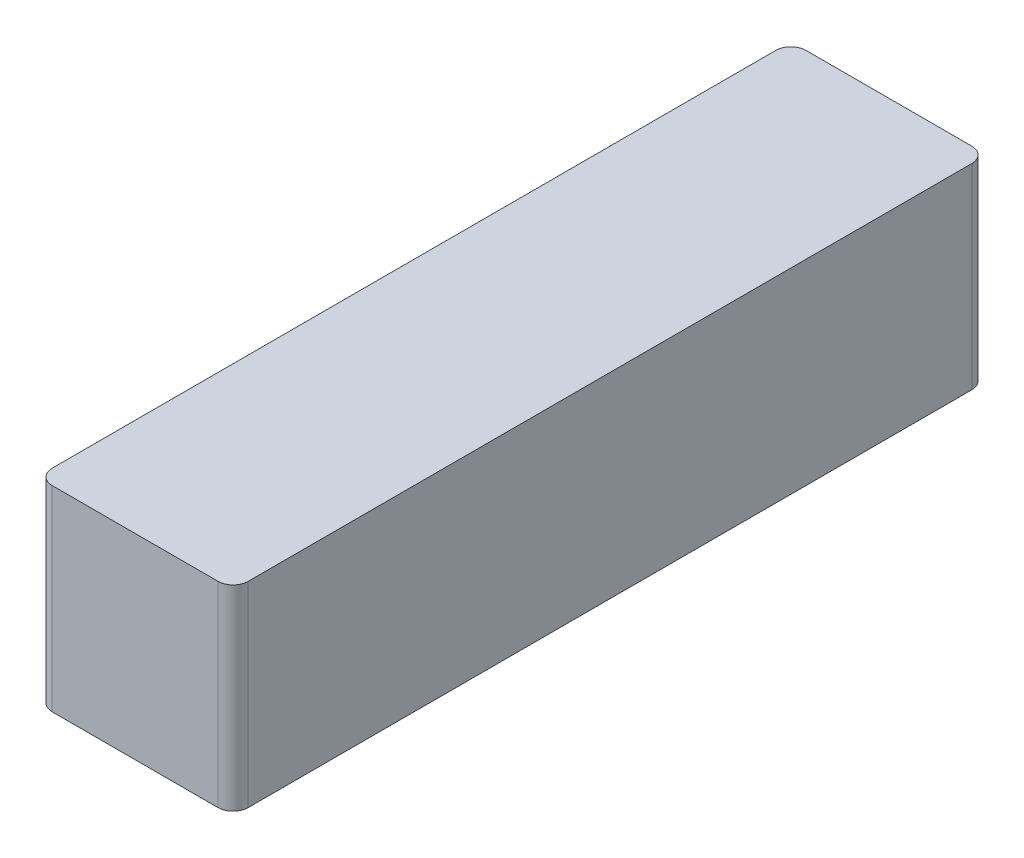
ISO-10303-21;
HEADER;
FILE_DESCRIPTION(('STEP AP214'),'2;1');
FILE_NAME('part.step','',(''),(''),'','','');
FILE_SCHEMA(('AUTOMOTIVE_DESIGN { 1 0 10303 214 1 1 1 1 }'));
ENDSEC;
DATA;
#1=APPLICATION_CONTEXT('core data for automotive mechanical design processes');
#2=APPLICATION_PROTOCOL_DEFINITION('international standard','automotive_design',2000,#1);
#3=PRODUCT_CONTEXT('',#1,'mechanical');
#4=PRODUCT('Part','Part','',(#3));
#5=PRODUCT_RELATED_PRODUCT_CATEGORY('part','',(#4));
#6=PRODUCT_DEFINITION_FORMATION('','',#4);
#7=PRODUCT_DEFINITION_CONTEXT('part definition',#1,'design');
#8=PRODUCT_DEFINITION('design','',#6,#7);
#9=PRODUCT_DEFINITION_SHAPE('','',#8);
#10=(LENGTH_UNIT() NAMED_UNIT(*) SI_UNIT(.MILLI.,.METRE.));
#11=(NAMED_UNIT(*) PLANE_ANGLE_UNIT() SI_UNIT($,.RADIAN.));
#12=(NAMED_UNIT(*) SI_UNIT($,.STERADIAN.) SOLID_ANGLE_UNIT());
#13=UNCERTAINTY_MEASURE_WITH_UNIT(LENGTH_MEASURE(1.E-05),#10,'distance_accuracy_value','');
#14=(GEOMETRIC_REPRESENTATION_CONTEXT(3) GLOBAL_UNCERTAINTY_ASSIGNED_CONTEXT((#13)) GLOBAL_UNIT_ASSIGNED_CONTEXT((#10,
#11,#12)) REPRESENTATION_CONTEXT('',''));
#15=CARTESIAN_POINT('',(0.,0.,0.));
#16=DIRECTION('',(0.,0.,1.));
#17=DIRECTION('',(1.,0.,0.));
#18=AXIS2_PLACEMENT_3D('',#15,#16,#17);
#19=CARTESIAN_POINT('',(1.651,1.651,12.7));
#20=DIRECTION('',(-1.,0.,0.));
#21=DIRECTION('',(0.,-1.,0.));
#22=AXIS2_PLACEMENT_3D('',#19,#20,#21);
#23=PLANE('',#22);
#24=DIRECTION('',(0.,0.,-1.));
#25=VECTOR('',#24,1.);
#26=CARTESIAN_POINT('',(1.651,-1.651,12.7));
#27=LINE('',#26,#25);
#28=CARTESIAN_POINT('',(1.651,-1.651,12.446));
#29=VERTEX_POINT('',#28);
#30=CARTESIAN_POINT('',(1.651,-1.651,0.254000000000001));
#31=VERTEX_POINT('',#30);
#32=EDGE_CURVE('E121',#29,#31,#27,.T.);
#33=ORIENTED_EDGE('',*,*,#32,.T.);
#34=DIRECTION('',(0.,1.,0.));
#35=VECTOR('',#34,1.);
#36=CARTESIAN_POINT('',(1.651,1.651,0.254000000000001));
#37=LINE('',#36,#35);
#38=CARTESIAN_POINT('',(1.651,1.651,0.254000000000001));
#39=VERTEX_POINT('',#38);
#40=EDGE_CURVE('E147',#31,#39,#37,.T.);
#41=ORIENTED_EDGE('',*,*,#40,.T.);
#42=DIRECTION('',(0.,0.,-1.));
#43=VECTOR('',#42,1.);
#44=CARTESIAN_POINT('',(1.651,1.651,12.7));
#45=LINE('',#44,#43);
#46=CARTESIAN_POINT('',(1.651,1.651,12.446));
#47=VERTEX_POINT('',#46);
#48=EDGE_CURVE('E126',#47,#39,#45,.T.);
#49=ORIENTED_EDGE('',*,*,#48,.F.);
#50=DIRECTION('',(0.,1.,0.));
#51=VECTOR('',#50,1.);
#52=CARTESIAN_POINT('',(1.651,-1.651,12.446));
#53=LINE('',#52,#51);
#54=EDGE_CURVE('E145',#47,#29,#53,.F.);
#55=ORIENTED_EDGE('',*,*,#54,.T.);
#56=EDGE_LOOP('',(#33,#41,#49,#55));
#57=FACE_BOUND('',#56,.T.);
#58=ADVANCED_FACE('F33',(#57),#23,.F.);
#59=CARTESIAN_POINT('',(-1.651,1.651,12.7));
#60=DIRECTION('',(0.,-1.,0.));
#61=DIRECTION('',(0.,0.,-1.));
#62=AXIS2_PLACEMENT_3D('',#59,#60,#61);
#63=PLANE('',#62);
#64=DIRECTION('',(-1.,0.,0.));
#65=VECTOR('',#64,1.);
#66=CARTESIAN_POINT('',(-1.651,1.651,0.));
#67=LINE('',#66,#65);
#68=CARTESIAN_POINT('',(1.397,1.651,0.));
#69=VERTEX_POINT('',#68);
#70=CARTESIAN_POINT('',(-1.397,1.651,0.));
#71=VERTEX_POINT('',#70);
#72=EDGE_CURVE('E162',#69,#71,#67,.T.);
#73=ORIENTED_EDGE('',*,*,#72,.T.);
#74=CARTESIAN_POINT('',(-1.397,1.651,0.254000000000001));
#75=DIRECTION('',(0.,-1.,0.));
#76=DIRECTION('',(0.,0.,-1.));
#77=AXIS2_PLACEMENT_3D('',#74,#75,#76);
#78=CIRCLE('',#77,0.254);
#79=CARTESIAN_POINT('',(-1.651,1.651,0.254000000000001));
#80=VERTEX_POINT('',#79);
#81=EDGE_CURVE('E143',#71,#80,#78,.F.);
#82=ORIENTED_EDGE('',*,*,#81,.T.);
#83=DIRECTION('',(0.,0.,-1.));
#84=VECTOR('',#83,1.);
#85=CARTESIAN_POINT('',(-1.651,1.651,12.7));
#86=LINE('',#85,#84);
#87=CARTESIAN_POINT('',(-1.651,1.651,12.446));
#88=VERTEX_POINT('',#87);
#89=EDGE_CURVE('E120',#88,#80,#86,.T.);
#90=ORIENTED_EDGE('',*,*,#89,.F.);
#91=CARTESIAN_POINT('',(-1.397,1.651,12.446));
#92=DIRECTION('',(0.,-1.,0.));
#93=DIRECTION('',(0.,0.,-1.));
#94=AXIS2_PLACEMENT_3D('',#91,#92,#93);
#95=CIRCLE('',#94,0.254);
#96=CARTESIAN_POINT('',(-1.397,1.651,12.7));
#97=VERTEX_POINT('',#96);
#98=EDGE_CURVE('E125',#88,#97,#95,.F.);
#99=ORIENTED_EDGE('',*,*,#98,.T.);
#100=DIRECTION('',(-1.,0.,0.));
#101=VECTOR('',#100,1.);
#102=CARTESIAN_POINT('',(-1.651,1.651,12.7));
#103=LINE('',#102,#101);
#104=CARTESIAN_POINT('',(1.397,1.651,12.7));
#105=VERTEX_POINT('',#104);
#106=EDGE_CURVE('E153',#105,#97,#103,.T.);
#107=ORIENTED_EDGE('',*,*,#106,.F.);
#108=CARTESIAN_POINT('',(1.397,1.651,12.446));
#109=DIRECTION('',(0.,-1.,0.));
#110=DIRECTION('',(0.,0.,-1.));
#111=AXIS2_PLACEMENT_3D('',#108,#109,#110);
#112=CIRCLE('',#111,0.254);
#113=EDGE_CURVE('E56',#105,#47,#112,.F.);
#114=ORIENTED_EDGE('',*,*,#113,.T.);
#115=ORIENTED_EDGE('',*,*,#48,.T.);
#116=CARTESIAN_POINT('',(1.397,1.651,0.254000000000001));
#117=DIRECTION('',(0.,-1.,0.));
#118=DIRECTION('',(0.,0.,-1.));
#119=AXIS2_PLACEMENT_3D('',#116,#117,#118);
#120=CIRCLE('',#119,0.254);
#121=EDGE_CURVE('E48',#39,#69,#120,.F.);
#122=ORIENTED_EDGE('',*,*,#121,.T.);
#123=EDGE_LOOP('',(#73,#82,#90,#99,#107,#114,#115,#122));
#124=FACE_BOUND('',#123,.T.);
#125=ADVANCED_FACE('F157',(#124),#63,.F.);
#126=CARTESIAN_POINT('',(-1.651,1.651,12.7));
#127=DIRECTION('',(1.,0.,0.));
#128=DIRECTION('',(0.,1.,0.));
#129=AXIS2_PLACEMENT_3D('',#126,#127,#128);
#130=PLANE('',#129);
#131=ORIENTED_EDGE('',*,*,#89,.T.);
#132=DIRECTION('',(0.,-1.,0.));
#133=VECTOR('',#132,1.);
#134=CARTESIAN_POINT('',(-1.651,1.651,0.254000000000001));
#135=LINE('',#134,#133);
#136=CARTESIAN_POINT('',(-1.651,-1.651,0.254000000000001));
#137=VERTEX_POINT('',#136);
#138=EDGE_CURVE('E119',#80,#137,#135,.T.);
#139=ORIENTED_EDGE('',*,*,#138,.T.);
#140=DIRECTION('',(0.,0.,-1.));
#141=VECTOR('',#140,1.);
#142=CARTESIAN_POINT('',(-1.651,-1.651,12.7));
#143=LINE('',#142,#141);
#144=CARTESIAN_POINT('',(-1.651,-1.651,12.446));
#145=VERTEX_POINT('',#144);
#146=EDGE_CURVE('E103',#145,#137,#143,.T.);
#147=ORIENTED_EDGE('',*,*,#146,.F.);
#148=DIRECTION('',(0.,-1.,0.));
#149=VECTOR('',#148,1.);
#150=CARTESIAN_POINT('',(-1.651,1.651,12.446));
#151=LINE('',#150,#149);
#152=EDGE_CURVE('E116',#145,#88,#151,.F.);
#153=ORIENTED_EDGE('',*,*,#152,.T.);
#154=EDGE_LOOP('',(#131,#139,#147,#153));
#155=FACE_BOUND('',#154,.T.);
#156=ADVANCED_FACE('F115',(#155),#130,.F.);
#157=CARTESIAN_POINT('',(-1.651,-1.651,12.7));
#158=DIRECTION('',(0.,1.,0.));
#159=DIRECTION('',(0.,0.,1.));
#160=AXIS2_PLACEMENT_3D('',#157,#158,#159);
#161=PLANE('',#160);
#162=ORIENTED_EDGE('',*,*,#146,.T.);
#163=CARTESIAN_POINT('',(-1.397,-1.651,0.254000000000001));
#164=DIRECTION('',(0.,1.,0.));
#165=DIRECTION('',(0.,0.,1.));
#166=AXIS2_PLACEMENT_3D('',#163,#164,#165);
#167=CIRCLE('',#166,0.254);
#168=CARTESIAN_POINT('',(-1.397,-1.651,0.));
#169=VERTEX_POINT('',#168);
#170=EDGE_CURVE('E134',#137,#169,#167,.F.);
#171=ORIENTED_EDGE('',*,*,#170,.T.);
#172=DIRECTION('',(1.,0.,0.));
#173=VECTOR('',#172,1.);
#174=CARTESIAN_POINT('',(-1.651,-1.651,0.));
#175=LINE('',#174,#173);
#176=CARTESIAN_POINT('',(1.397,-1.651,0.));
#177=VERTEX_POINT('',#176);
#178=EDGE_CURVE('E158',#169,#177,#175,.T.);
#179=ORIENTED_EDGE('',*,*,#178,.T.);
#180=CARTESIAN_POINT('',(1.397,-1.651,0.254000000000001));
#181=DIRECTION('',(0.,1.,0.));
#182=DIRECTION('',(0.,0.,1.));
#183=AXIS2_PLACEMENT_3D('',#180,#181,#182);
#184=CIRCLE('',#183,0.254);
#185=EDGE_CURVE('E109',#177,#31,#184,.F.);
#186=ORIENTED_EDGE('',*,*,#185,.T.);
#187=ORIENTED_EDGE('',*,*,#32,.F.);
#188=CARTESIAN_POINT('',(1.397,-1.651,12.446));
#189=DIRECTION('',(0.,1.,0.));
#190=DIRECTION('',(0.,0.,1.));
#191=AXIS2_PLACEMENT_3D('',#188,#189,#190);
#192=CIRCLE('',#191,0.254);
#193=CARTESIAN_POINT('',(1.397,-1.651,12.7));
#194=VERTEX_POINT('',#193);
#195=EDGE_CURVE('E110',#29,#194,#192,.F.);
#196=ORIENTED_EDGE('',*,*,#195,.T.);
#197=DIRECTION('',(1.,0.,0.));
#198=VECTOR('',#197,1.);
#199=CARTESIAN_POINT('',(-1.651,-1.651,12.7));
#200=LINE('',#199,#198);
#201=CARTESIAN_POINT('',(-1.397,-1.651,12.7));
#202=VERTEX_POINT('',#201);
#203=EDGE_CURVE('E105',#202,#194,#200,.T.);
#204=ORIENTED_EDGE('',*,*,#203,.F.);
#205=CARTESIAN_POINT('',(-1.397,-1.651,12.446));
#206=DIRECTION('',(0.,1.,0.));
#207=DIRECTION('',(0.,0.,1.));
#208=AXIS2_PLACEMENT_3D('',#205,#206,#207);
#209=CIRCLE('',#208,0.254);
#210=EDGE_CURVE('E100',#202,#145,#209,.F.);
#211=ORIENTED_EDGE('',*,*,#210,.T.);
#212=EDGE_LOOP('',(#162,#171,#179,#186,#187,#196,#204,#211));
#213=FACE_BOUND('',#212,.T.);
#214=ADVANCED_FACE('F102',(#213),#161,.F.);
#215=CARTESIAN_POINT('',(0.,0.,12.7));
#216=DIRECTION('',(0.,0.,1.));
#217=DIRECTION('',(1.,0.,0.));
#218=AXIS2_PLACEMENT_3D('',#215,#216,#217);
#219=PLANE('',#218);
#220=ORIENTED_EDGE('',*,*,#106,.T.);
#221=DIRECTION('',(0.,-1.,0.));
#222=VECTOR('',#221,1.);
#223=CARTESIAN_POINT('',(-1.397,-1.651,12.7));
#224=LINE('',#223,#222);
#225=EDGE_CURVE('E11',#97,#202,#224,.T.);
#226=ORIENTED_EDGE('',*,*,#225,.T.);
#227=ORIENTED_EDGE('',*,*,#203,.T.);
#228=DIRECTION('',(0.,1.,0.));
#229=VECTOR('',#228,1.);
#230=CARTESIAN_POINT('',(1.397,1.651,12.7));
#231=LINE('',#230,#229);
#232=EDGE_CURVE('E41',#194,#105,#231,.T.);
#233=ORIENTED_EDGE('',*,*,#232,.T.);
#234=EDGE_LOOP('',(#220,#226,#227,#233));
#235=FACE_BOUND('',#234,.T.);
#236=ADVANCED_FACE('F152',(#235),#219,.T.);
#237=CARTESIAN_POINT('',(0.,0.,0.));
#238=DIRECTION('',(0.,0.,1.));
#239=DIRECTION('',(1.,0.,0.));
#240=AXIS2_PLACEMENT_3D('',#237,#238,#239);
#241=PLANE('',#240);
#242=ORIENTED_EDGE('',*,*,#178,.F.);
#243=DIRECTION('',(0.,-1.,0.));
#244=VECTOR('',#243,1.);
#245=CARTESIAN_POINT('',(-1.397,0.,0.));
#246=LINE('',#245,#244);
#247=EDGE_CURVE('E138',#169,#71,#246,.F.);
#248=ORIENTED_EDGE('',*,*,#247,.T.);
#249=ORIENTED_EDGE('',*,*,#72,.F.);
#250=DIRECTION('',(0.,1.,0.));
#251=VECTOR('',#250,1.);
#252=CARTESIAN_POINT('',(1.397,0.,0.));
#253=LINE('',#252,#251);
#254=EDGE_CURVE('E136',#69,#177,#253,.F.);
#255=ORIENTED_EDGE('',*,*,#254,.T.);
#256=EDGE_LOOP('',(#242,#248,#249,#255));
#257=FACE_BOUND('',#256,.T.);
#258=ADVANCED_FACE('F174',(#257),#241,.F.);
#259=CARTESIAN_POINT('',(-1.397,1.651,0.254000000000001));
#260=DIRECTION('',(0.,-1.,0.));
#261=DIRECTION('',(1.,0.,0.));
#262=AXIS2_PLACEMENT_3D('',#259,#260,#261);
#263=CYLINDRICAL_SURFACE('',#262,0.254);
#264=ORIENTED_EDGE('',*,*,#81,.F.);
#265=ORIENTED_EDGE('',*,*,#247,.F.);
#266=ORIENTED_EDGE('',*,*,#170,.F.);
#267=ORIENTED_EDGE('',*,*,#138,.F.);
#268=EDGE_LOOP('',(#264,#265,#266,#267));
#269=FACE_BOUND('',#268,.T.);
#270=ADVANCED_FACE('F169',(#269),#263,.T.);
#271=CARTESIAN_POINT('',(1.397,1.651,0.254000000000001));
#272=DIRECTION('',(0.,1.,0.));
#273=DIRECTION('',(-1.,0.,0.));
#274=AXIS2_PLACEMENT_3D('',#271,#272,#273);
#275=CYLINDRICAL_SURFACE('',#274,0.254);
#276=ORIENTED_EDGE('',*,*,#185,.F.);
#277=ORIENTED_EDGE('',*,*,#254,.F.);
#278=ORIENTED_EDGE('',*,*,#121,.F.);
#279=ORIENTED_EDGE('',*,*,#40,.F.);
#280=EDGE_LOOP('',(#276,#277,#278,#279));
#281=FACE_BOUND('',#280,.T.);
#282=ADVANCED_FACE('F176',(#281),#275,.T.);
#283=CARTESIAN_POINT('',(-1.397,0.,12.446));
#284=DIRECTION('',(0.,1.,0.));
#285=DIRECTION('',(-1.,0.,0.));
#286=AXIS2_PLACEMENT_3D('',#283,#284,#285);
#287=CYLINDRICAL_SURFACE('',#286,0.254);
#288=ORIENTED_EDGE('',*,*,#98,.F.);
#289=ORIENTED_EDGE('',*,*,#152,.F.);
#290=ORIENTED_EDGE('',*,*,#210,.F.);
#291=ORIENTED_EDGE('',*,*,#225,.F.);
#292=EDGE_LOOP('',(#288,#289,#290,#291));
#293=FACE_BOUND('',#292,.T.);
#294=ADVANCED_FACE('F124',(#293),#287,.T.);
#295=CARTESIAN_POINT('',(1.397,0.,12.446));
#296=DIRECTION('',(0.,-1.,0.));
#297=DIRECTION('',(1.,0.,0.));
#298=AXIS2_PLACEMENT_3D('',#295,#296,#297);
#299=CYLINDRICAL_SURFACE('',#298,0.254);
#300=ORIENTED_EDGE('',*,*,#195,.F.);
#301=ORIENTED_EDGE('',*,*,#54,.F.);
#302=ORIENTED_EDGE('',*,*,#113,.F.);
#303=ORIENTED_EDGE('',*,*,#232,.F.);
#304=EDGE_LOOP('',(#300,#301,#302,#303));
#305=FACE_BOUND('',#304,.T.);
#306=ADVANCED_FACE('F35',(#305),#299,.T.);
#307=CLOSED_SHELL('',(#58,#125,#156,#214,#236,#258,#270,#282,#294,#306));
#308=MANIFOLD_SOLID_BREP('B2',#307);
#309=ADVANCED_BREP_SHAPE_REPRESENTATION('',(#18,#308),#14);
#310=SHAPE_DEFINITION_REPRESENTATION(#9,#309);
ENDSEC;
END-ISO-10303-21;
